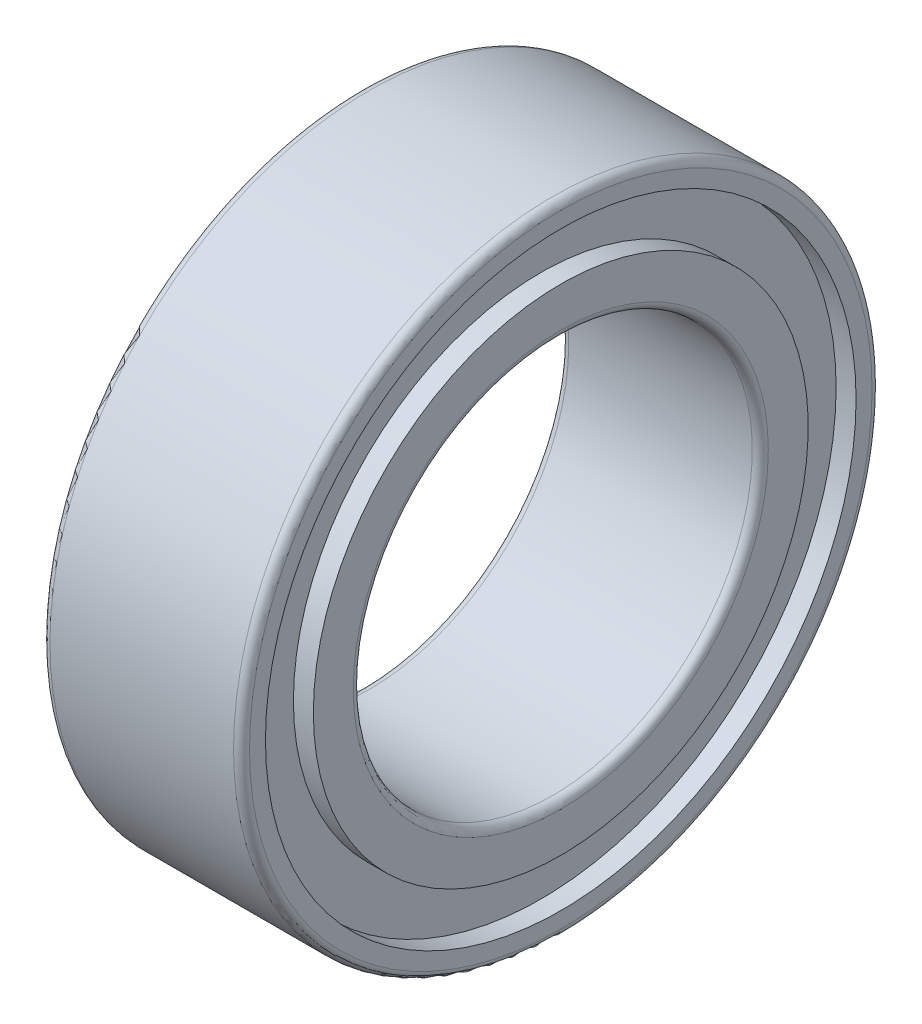
ISO-10303-21;
HEADER;
FILE_DESCRIPTION(('STEP AP214'),'2;1');
FILE_NAME('part.step','',(''),(''),'','','');
FILE_SCHEMA(('AUTOMOTIVE_DESIGN { 1 0 10303 214 1 1 1 1 }'));
ENDSEC;
DATA;
#1=APPLICATION_CONTEXT('core data for automotive mechanical design processes');
#2=APPLICATION_PROTOCOL_DEFINITION('international standard','automotive_design',2000,#1);
#3=PRODUCT_CONTEXT('',#1,'mechanical');
#4=PRODUCT('Part','Part','',(#3));
#5=PRODUCT_RELATED_PRODUCT_CATEGORY('part','',(#4));
#6=PRODUCT_DEFINITION_FORMATION('','',#4);
#7=PRODUCT_DEFINITION_CONTEXT('part definition',#1,'design');
#8=PRODUCT_DEFINITION('design','',#6,#7);
#9=PRODUCT_DEFINITION_SHAPE('','',#8);
#10=(LENGTH_UNIT() NAMED_UNIT(*) SI_UNIT(.MILLI.,.METRE.));
#11=(NAMED_UNIT(*) PLANE_ANGLE_UNIT() SI_UNIT($,.RADIAN.));
#12=(NAMED_UNIT(*) SI_UNIT($,.STERADIAN.) SOLID_ANGLE_UNIT());
#13=UNCERTAINTY_MEASURE_WITH_UNIT(LENGTH_MEASURE(1.E-05),#10,'distance_accuracy_value','');
#14=(GEOMETRIC_REPRESENTATION_CONTEXT(3) GLOBAL_UNCERTAINTY_ASSIGNED_CONTEXT((#13)) GLOBAL_UNIT_ASSIGNED_CONTEXT((#10,
#11,#12)) REPRESENTATION_CONTEXT('',''));
#15=CARTESIAN_POINT('',(0.,0.,0.));
#16=DIRECTION('',(0.,0.,1.));
#17=DIRECTION('',(1.,0.,0.));
#18=AXIS2_PLACEMENT_3D('',#15,#16,#17);
#19=CARTESIAN_POINT('',(0.,0.,0.));
#20=DIRECTION('',(-1.,0.,0.));
#21=DIRECTION('',(0.,0.,1.));
#22=AXIS2_PLACEMENT_3D('',#19,#20,#21);
#23=CYLINDRICAL_SURFACE('',#22,4.);
#24=CARTESIAN_POINT('',(0.1,0.,0.));
#25=DIRECTION('',(1.,0.,0.));
#26=DIRECTION('',(0.,0.,-1.));
#27=AXIS2_PLACEMENT_3D('',#24,#25,#26);
#28=CIRCLE('',#27,4.);
#29=CARTESIAN_POINT('',(0.1,0.,-4.));
#30=VERTEX_POINT('',#29);
#31=EDGE_CURVE('E42',#30,#30,#28,.T.);
#32=ORIENTED_EDGE('',*,*,#31,.T.);
#33=EDGE_LOOP('',(#32));
#34=FACE_BOUND('',#33,.T.);
#35=CARTESIAN_POINT('',(2.4,0.,0.));
#36=DIRECTION('',(-1.,0.,0.));
#37=DIRECTION('',(0.,0.,1.));
#38=AXIS2_PLACEMENT_3D('',#35,#36,#37);
#39=CIRCLE('',#38,4.);
#40=CARTESIAN_POINT('',(2.4,0.,4.));
#41=VERTEX_POINT('',#40);
#42=EDGE_CURVE('E46',#41,#41,#39,.T.);
#43=ORIENTED_EDGE('',*,*,#42,.T.);
#44=EDGE_LOOP('',(#43));
#45=FACE_BOUND('',#44,.T.);
#46=ADVANCED_FACE('F31',(#34,#45),#23,.T.);
#47=CARTESIAN_POINT('',(0.,4.,0.));
#48=DIRECTION('',(1.,0.,0.));
#49=DIRECTION('',(0.,0.,-1.));
#50=AXIS2_PLACEMENT_3D('',#47,#48,#49);
#51=PLANE('',#50);
#52=CARTESIAN_POINT('',(0.,0.,0.));
#53=DIRECTION('',(1.,0.,0.));
#54=DIRECTION('',(0.,0.,-1.));
#55=AXIS2_PLACEMENT_3D('',#52,#53,#54);
#56=CIRCLE('',#55,3.9);
#57=CARTESIAN_POINT('',(0.,0.,-3.9));
#58=VERTEX_POINT('',#57);
#59=EDGE_CURVE('E51',#58,#58,#56,.F.);
#60=ORIENTED_EDGE('',*,*,#59,.T.);
#61=EDGE_LOOP('',(#60));
#62=FACE_BOUND('',#61,.T.);
#63=CARTESIAN_POINT('',(0.,0.,0.));
#64=DIRECTION('',(-1.,0.,0.));
#65=DIRECTION('',(0.,0.,1.));
#66=AXIS2_PLACEMENT_3D('',#63,#64,#65);
#67=CIRCLE('',#66,3.7);
#68=CARTESIAN_POINT('',(0.,0.,3.7));
#69=VERTEX_POINT('',#68);
#70=EDGE_CURVE('E63',#69,#69,#67,.T.);
#71=ORIENTED_EDGE('',*,*,#70,.F.);
#72=EDGE_LOOP('',(#71));
#73=FACE_BOUND('',#72,.T.);
#74=ADVANCED_FACE('F119',(#62,#73),#51,.F.);
#75=CARTESIAN_POINT('',(0.,0.,0.));
#76=DIRECTION('',(-1.,0.,0.));
#77=DIRECTION('',(0.,0.,1.));
#78=AXIS2_PLACEMENT_3D('',#75,#76,#77);
#79=CYLINDRICAL_SURFACE('',#78,3.7);
#80=CARTESIAN_POINT('',(0.25,0.,0.));
#81=DIRECTION('',(-1.,0.,0.));
#82=DIRECTION('',(0.,0.,1.));
#83=AXIS2_PLACEMENT_3D('',#80,#81,#82);
#84=CIRCLE('',#83,3.7);
#85=CARTESIAN_POINT('',(0.25,0.,3.7));
#86=VERTEX_POINT('',#85);
#87=EDGE_CURVE('E66',#86,#86,#84,.T.);
#88=ORIENTED_EDGE('',*,*,#87,.F.);
#89=EDGE_LOOP('',(#88));
#90=FACE_BOUND('',#89,.T.);
#91=ORIENTED_EDGE('',*,*,#70,.T.);
#92=EDGE_LOOP('',(#91));
#93=FACE_BOUND('',#92,.T.);
#94=ADVANCED_FACE('F125',(#90,#93),#79,.F.);
#95=CARTESIAN_POINT('',(0.25,3.7,0.));
#96=DIRECTION('',(1.,0.,0.));
#97=DIRECTION('',(0.,0.,-1.));
#98=AXIS2_PLACEMENT_3D('',#95,#96,#97);
#99=PLANE('',#98);
#100=CARTESIAN_POINT('',(0.25,0.,0.));
#101=DIRECTION('',(-1.,0.,0.));
#102=DIRECTION('',(0.,0.,1.));
#103=AXIS2_PLACEMENT_3D('',#100,#101,#102);
#104=CIRCLE('',#103,3.1);
#105=CARTESIAN_POINT('',(0.25,0.,3.1));
#106=VERTEX_POINT('',#105);
#107=EDGE_CURVE('E69',#106,#106,#104,.T.);
#108=ORIENTED_EDGE('',*,*,#107,.F.);
#109=EDGE_LOOP('',(#108));
#110=FACE_BOUND('',#109,.T.);
#111=ORIENTED_EDGE('',*,*,#87,.T.);
#112=EDGE_LOOP('',(#111));
#113=FACE_BOUND('',#112,.T.);
#114=ADVANCED_FACE('F235',(#110,#113),#99,.F.);
#115=CARTESIAN_POINT('',(0.,0.,0.));
#116=DIRECTION('',(-1.,0.,0.));
#117=DIRECTION('',(0.,0.,1.));
#118=AXIS2_PLACEMENT_3D('',#115,#116,#117);
#119=CYLINDRICAL_SURFACE('',#118,3.1);
#120=CARTESIAN_POINT('',(0.,0.,0.));
#121=DIRECTION('',(-1.,0.,0.));
#122=DIRECTION('',(0.,0.,1.));
#123=AXIS2_PLACEMENT_3D('',#120,#121,#122);
#124=CIRCLE('',#123,3.1);
#125=CARTESIAN_POINT('',(0.,0.,3.1));
#126=VERTEX_POINT('',#125);
#127=EDGE_CURVE('E72',#126,#126,#124,.T.);
#128=ORIENTED_EDGE('',*,*,#127,.F.);
#129=EDGE_LOOP('',(#128));
#130=FACE_BOUND('',#129,.T.);
#131=ORIENTED_EDGE('',*,*,#107,.T.);
#132=EDGE_LOOP('',(#131));
#133=FACE_BOUND('',#132,.T.);
#134=ADVANCED_FACE('F197',(#130,#133),#119,.T.);
#135=CARTESIAN_POINT('',(0.,3.1,0.));
#136=DIRECTION('',(1.,0.,0.));
#137=DIRECTION('',(0.,0.,-1.));
#138=AXIS2_PLACEMENT_3D('',#135,#136,#137);
#139=PLANE('',#138);
#140=CARTESIAN_POINT('',(0.,0.,0.));
#141=DIRECTION('',(1.,0.,0.));
#142=DIRECTION('',(0.,0.,-1.));
#143=AXIS2_PLACEMENT_3D('',#140,#141,#142);
#144=CIRCLE('',#143,2.6);
#145=CARTESIAN_POINT('',(0.,0.,-2.6));
#146=VERTEX_POINT('',#145);
#147=EDGE_CURVE('E54',#146,#146,#144,.T.);
#148=ORIENTED_EDGE('',*,*,#147,.T.);
#149=EDGE_LOOP('',(#148));
#150=FACE_BOUND('',#149,.T.);
#151=ORIENTED_EDGE('',*,*,#127,.T.);
#152=EDGE_LOOP('',(#151));
#153=FACE_BOUND('',#152,.T.);
#154=ADVANCED_FACE('F115',(#150,#153),#139,.F.);
#155=CARTESIAN_POINT('',(0.,0.,0.));
#156=DIRECTION('',(-1.,0.,0.));
#157=DIRECTION('',(0.,0.,1.));
#158=AXIS2_PLACEMENT_3D('',#155,#156,#157);
#159=CYLINDRICAL_SURFACE('',#158,2.5);
#160=CARTESIAN_POINT('',(0.1,0.,0.));
#161=DIRECTION('',(1.,0.,0.));
#162=DIRECTION('',(0.,0.,-1.));
#163=AXIS2_PLACEMENT_3D('',#160,#161,#162);
#164=CIRCLE('',#163,2.5);
#165=CARTESIAN_POINT('',(0.1,0.,-2.5));
#166=VERTEX_POINT('',#165);
#167=EDGE_CURVE('E57',#166,#166,#164,.F.);
#168=ORIENTED_EDGE('',*,*,#167,.T.);
#169=EDGE_LOOP('',(#168));
#170=FACE_BOUND('',#169,.T.);
#171=CARTESIAN_POINT('',(2.4,0.,0.));
#172=DIRECTION('',(-1.,0.,0.));
#173=DIRECTION('',(0.,0.,1.));
#174=AXIS2_PLACEMENT_3D('',#171,#172,#173);
#175=CIRCLE('',#174,2.5);
#176=CARTESIAN_POINT('',(2.4,0.,2.5));
#177=VERTEX_POINT('',#176);
#178=EDGE_CURVE('E60',#177,#177,#175,.F.);
#179=ORIENTED_EDGE('',*,*,#178,.T.);
#180=EDGE_LOOP('',(#179));
#181=FACE_BOUND('',#180,.T.);
#182=ADVANCED_FACE('F110',(#170,#181),#159,.F.);
#183=CARTESIAN_POINT('',(2.5,2.5,0.));
#184=DIRECTION('',(-1.,0.,0.));
#185=DIRECTION('',(0.,0.,1.));
#186=AXIS2_PLACEMENT_3D('',#183,#184,#185);
#187=PLANE('',#186);
#188=CARTESIAN_POINT('',(2.5,0.,0.));
#189=DIRECTION('',(-1.,0.,0.));
#190=DIRECTION('',(0.,0.,1.));
#191=AXIS2_PLACEMENT_3D('',#188,#189,#190);
#192=CIRCLE('',#191,2.6);
#193=CARTESIAN_POINT('',(2.5,0.,2.6));
#194=VERTEX_POINT('',#193);
#195=EDGE_CURVE('E38',#194,#194,#192,.T.);
#196=ORIENTED_EDGE('',*,*,#195,.T.);
#197=EDGE_LOOP('',(#196));
#198=FACE_BOUND('',#197,.T.);
#199=CARTESIAN_POINT('',(2.5,0.,0.));
#200=DIRECTION('',(-1.,0.,0.));
#201=DIRECTION('',(0.,0.,1.));
#202=AXIS2_PLACEMENT_3D('',#199,#200,#201);
#203=CIRCLE('',#202,3.1);
#204=CARTESIAN_POINT('',(2.5,0.,3.1));
#205=VERTEX_POINT('',#204);
#206=EDGE_CURVE('E75',#205,#205,#203,.T.);
#207=ORIENTED_EDGE('',*,*,#206,.F.);
#208=EDGE_LOOP('',(#207));
#209=FACE_BOUND('',#208,.T.);
#210=ADVANCED_FACE('F105',(#198,#209),#187,.F.);
#211=CARTESIAN_POINT('',(0.,0.,0.));
#212=DIRECTION('',(-1.,0.,0.));
#213=DIRECTION('',(0.,0.,1.));
#214=AXIS2_PLACEMENT_3D('',#211,#212,#213);
#215=CYLINDRICAL_SURFACE('',#214,3.1);
#216=CARTESIAN_POINT('',(2.25,0.,0.));
#217=DIRECTION('',(-1.,0.,0.));
#218=DIRECTION('',(0.,0.,1.));
#219=AXIS2_PLACEMENT_3D('',#216,#217,#218);
#220=CIRCLE('',#219,3.1);
#221=CARTESIAN_POINT('',(2.25,0.,3.1));
#222=VERTEX_POINT('',#221);
#223=EDGE_CURVE('E78',#222,#222,#220,.T.);
#224=ORIENTED_EDGE('',*,*,#223,.F.);
#225=EDGE_LOOP('',(#224));
#226=FACE_BOUND('',#225,.T.);
#227=ORIENTED_EDGE('',*,*,#206,.T.);
#228=EDGE_LOOP('',(#227));
#229=FACE_BOUND('',#228,.T.);
#230=ADVANCED_FACE('F99',(#226,#229),#215,.T.);
#231=CARTESIAN_POINT('',(2.25,3.7,0.));
#232=DIRECTION('',(-1.,0.,0.));
#233=DIRECTION('',(0.,0.,1.));
#234=AXIS2_PLACEMENT_3D('',#231,#232,#233);
#235=PLANE('',#234);
#236=CARTESIAN_POINT('',(2.25,0.,0.));
#237=DIRECTION('',(-1.,0.,0.));
#238=DIRECTION('',(0.,0.,1.));
#239=AXIS2_PLACEMENT_3D('',#236,#237,#238);
#240=CIRCLE('',#239,3.7);
#241=CARTESIAN_POINT('',(2.25,0.,3.7));
#242=VERTEX_POINT('',#241);
#243=EDGE_CURVE('E81',#242,#242,#240,.T.);
#244=ORIENTED_EDGE('',*,*,#243,.F.);
#245=EDGE_LOOP('',(#244));
#246=FACE_BOUND('',#245,.T.);
#247=ORIENTED_EDGE('',*,*,#223,.T.);
#248=EDGE_LOOP('',(#247));
#249=FACE_BOUND('',#248,.T.);
#250=ADVANCED_FACE('F93',(#246,#249),#235,.F.);
#251=CARTESIAN_POINT('',(0.,0.,0.));
#252=DIRECTION('',(-1.,0.,0.));
#253=DIRECTION('',(0.,0.,1.));
#254=AXIS2_PLACEMENT_3D('',#251,#252,#253);
#255=CYLINDRICAL_SURFACE('',#254,3.7);
#256=CARTESIAN_POINT('',(2.5,0.,0.));
#257=DIRECTION('',(-1.,0.,0.));
#258=DIRECTION('',(0.,0.,1.));
#259=AXIS2_PLACEMENT_3D('',#256,#257,#258);
#260=CIRCLE('',#259,3.7);
#261=CARTESIAN_POINT('',(2.5,0.,3.7));
#262=VERTEX_POINT('',#261);
#263=EDGE_CURVE('E84',#262,#262,#260,.T.);
#264=ORIENTED_EDGE('',*,*,#263,.F.);
#265=EDGE_LOOP('',(#264));
#266=FACE_BOUND('',#265,.T.);
#267=ORIENTED_EDGE('',*,*,#243,.T.);
#268=EDGE_LOOP('',(#267));
#269=FACE_BOUND('',#268,.T.);
#270=ADVANCED_FACE('F90',(#266,#269),#255,.F.);
#271=CARTESIAN_POINT('',(2.5,3.7,0.));
#272=DIRECTION('',(-1.,0.,0.));
#273=DIRECTION('',(0.,0.,1.));
#274=AXIS2_PLACEMENT_3D('',#271,#272,#273);
#275=PLANE('',#274);
#276=CARTESIAN_POINT('',(2.5,0.,0.));
#277=DIRECTION('',(-1.,0.,0.));
#278=DIRECTION('',(0.,0.,1.));
#279=AXIS2_PLACEMENT_3D('',#276,#277,#278);
#280=CIRCLE('',#279,3.9);
#281=CARTESIAN_POINT('',(2.5,0.,3.9));
#282=VERTEX_POINT('',#281);
#283=EDGE_CURVE('E10',#282,#282,#280,.F.);
#284=ORIENTED_EDGE('',*,*,#283,.T.);
#285=EDGE_LOOP('',(#284));
#286=FACE_BOUND('',#285,.T.);
#287=ORIENTED_EDGE('',*,*,#263,.T.);
#288=EDGE_LOOP('',(#287));
#289=FACE_BOUND('',#288,.T.);
#290=ADVANCED_FACE('F88',(#286,#289),#275,.F.);
#291=CARTESIAN_POINT('',(0.1,0.,0.));
#292=DIRECTION('',(1.,0.,0.));
#293=DIRECTION('',(0.,0.,-1.));
#294=AXIS2_PLACEMENT_3D('',#291,#292,#293);
#295=TOROIDAL_SURFACE('',#294,2.6,0.1);
#296=ORIENTED_EDGE('',*,*,#147,.F.);
#297=EDGE_LOOP('',(#296));
#298=FACE_BOUND('',#297,.T.);
#299=ORIENTED_EDGE('',*,*,#167,.F.);
#300=EDGE_LOOP('',(#299));
#301=FACE_BOUND('',#300,.T.);
#302=ADVANCED_FACE('F131',(#298,#301),#295,.T.);
#303=CARTESIAN_POINT('',(0.1,0.,0.));
#304=DIRECTION('',(1.,0.,0.));
#305=DIRECTION('',(0.,0.,-1.));
#306=AXIS2_PLACEMENT_3D('',#303,#304,#305);
#307=TOROIDAL_SURFACE('',#306,3.9,0.1);
#308=ORIENTED_EDGE('',*,*,#31,.F.);
#309=EDGE_LOOP('',(#308));
#310=FACE_BOUND('',#309,.T.);
#311=ORIENTED_EDGE('',*,*,#59,.F.);
#312=EDGE_LOOP('',(#311));
#313=FACE_BOUND('',#312,.T.);
#314=ADVANCED_FACE('F134',(#310,#313),#307,.T.);
#315=CARTESIAN_POINT('',(2.4,0.,0.));
#316=DIRECTION('',(-1.,0.,0.));
#317=DIRECTION('',(0.,0.,1.));
#318=AXIS2_PLACEMENT_3D('',#315,#316,#317);
#319=TOROIDAL_SURFACE('',#318,2.6,0.1);
#320=ORIENTED_EDGE('',*,*,#178,.F.);
#321=EDGE_LOOP('',(#320));
#322=FACE_BOUND('',#321,.T.);
#323=ORIENTED_EDGE('',*,*,#195,.F.);
#324=EDGE_LOOP('',(#323));
#325=FACE_BOUND('',#324,.T.);
#326=ADVANCED_FACE('F137',(#322,#325),#319,.T.);
#327=CARTESIAN_POINT('',(2.4,0.,0.));
#328=DIRECTION('',(-1.,0.,0.));
#329=DIRECTION('',(0.,0.,1.));
#330=AXIS2_PLACEMENT_3D('',#327,#328,#329);
#331=TOROIDAL_SURFACE('',#330,3.9,0.1);
#332=ORIENTED_EDGE('',*,*,#283,.F.);
#333=EDGE_LOOP('',(#332));
#334=FACE_BOUND('',#333,.T.);
#335=ORIENTED_EDGE('',*,*,#42,.F.);
#336=EDGE_LOOP('',(#335));
#337=FACE_BOUND('',#336,.T.);
#338=ADVANCED_FACE('F33',(#334,#337),#331,.T.);
#339=CLOSED_SHELL('',(#46,#74,#94,#114,#134,#154,#182,#210,#230,#250,#270,#290,#302,#314,#326,#338));
#340=MANIFOLD_SOLID_BREP('B2',#339);
#341=ADVANCED_BREP_SHAPE_REPRESENTATION('',(#18,#340),#14);
#342=SHAPE_DEFINITION_REPRESENTATION(#9,#341);
ENDSEC;
END-ISO-10303-21;
